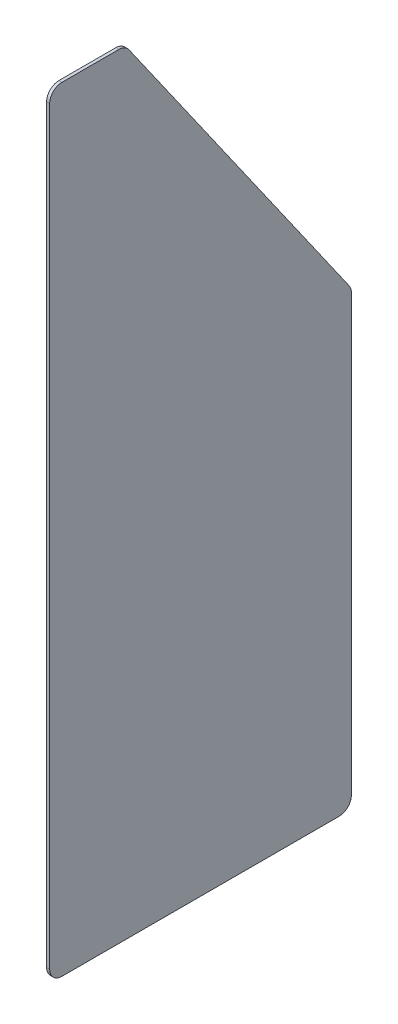
ISO-10303-21;
HEADER;
FILE_DESCRIPTION(('STEP AP214'),'2;1');
FILE_NAME('part.step','',(''),(''),'','','');
FILE_SCHEMA(('AUTOMOTIVE_DESIGN { 1 0 10303 214 1 1 1 1 }'));
ENDSEC;
DATA;
#1=APPLICATION_CONTEXT('core data for automotive mechanical design processes');
#2=APPLICATION_PROTOCOL_DEFINITION('international standard','automotive_design',2000,#1);
#3=PRODUCT_CONTEXT('',#1,'mechanical');
#4=PRODUCT('Part','Part','',(#3));
#5=PRODUCT_RELATED_PRODUCT_CATEGORY('part','',(#4));
#6=PRODUCT_DEFINITION_FORMATION('','',#4);
#7=PRODUCT_DEFINITION_CONTEXT('part definition',#1,'design');
#8=PRODUCT_DEFINITION('design','',#6,#7);
#9=PRODUCT_DEFINITION_SHAPE('','',#8);
#10=(LENGTH_UNIT() NAMED_UNIT(*) SI_UNIT(.MILLI.,.METRE.));
#11=(NAMED_UNIT(*) PLANE_ANGLE_UNIT() SI_UNIT($,.RADIAN.));
#12=(NAMED_UNIT(*) SI_UNIT($,.STERADIAN.) SOLID_ANGLE_UNIT());
#13=UNCERTAINTY_MEASURE_WITH_UNIT(LENGTH_MEASURE(1.E-05),#10,'distance_accuracy_value','');
#14=(GEOMETRIC_REPRESENTATION_CONTEXT(3) GLOBAL_UNCERTAINTY_ASSIGNED_CONTEXT((#13)) GLOBAL_UNIT_ASSIGNED_CONTEXT((#10,
#11,#12)) REPRESENTATION_CONTEXT('',''));
#15=CARTESIAN_POINT('',(0.,0.,0.));
#16=DIRECTION('',(0.,0.,1.));
#17=DIRECTION('',(1.,0.,0.));
#18=AXIS2_PLACEMENT_3D('',#15,#16,#17);
#19=CARTESIAN_POINT('',(1.58750000000002,400.05,0.));
#20=DIRECTION('',(0.,0.,-1.));
#21=DIRECTION('',(-1.,0.,0.));
#22=AXIS2_PLACEMENT_3D('',#19,#20,#21);
#23=PLANE('',#22);
#24=DIRECTION('',(0.,-1.,0.));
#25=VECTOR('',#24,1.);
#26=CARTESIAN_POINT('',(0.,400.05,0.));
#27=LINE('',#26,#25);
#28=CARTESIAN_POINT('',(0.,393.7,0.));
#29=VERTEX_POINT('',#28);
#30=CARTESIAN_POINT('',(0.,6.35000000000013,0.));
#31=VERTEX_POINT('',#30);
#32=EDGE_CURVE('E134',#29,#31,#27,.T.);
#33=ORIENTED_EDGE('',*,*,#32,.T.);
#34=DIRECTION('',(1.,0.,0.));
#35=VECTOR('',#34,1.);
#36=CARTESIAN_POINT('',(1.58750000000002,6.35000000000002,0.));
#37=LINE('',#36,#35);
#38=CARTESIAN_POINT('',(1.58750000000002,6.35000000000013,0.));
#39=VERTEX_POINT('',#38);
#40=EDGE_CURVE('E164',#31,#39,#37,.T.);
#41=ORIENTED_EDGE('',*,*,#40,.T.);
#42=DIRECTION('',(0.,-1.,0.));
#43=VECTOR('',#42,1.);
#44=CARTESIAN_POINT('',(1.58750000000002,400.05,0.));
#45=LINE('',#44,#43);
#46=CARTESIAN_POINT('',(1.58750000000002,393.7,0.));
#47=VERTEX_POINT('',#46);
#48=EDGE_CURVE('E138',#47,#39,#45,.T.);
#49=ORIENTED_EDGE('',*,*,#48,.F.);
#50=DIRECTION('',(1.,0.,0.));
#51=VECTOR('',#50,1.);
#52=CARTESIAN_POINT('',(0.,393.7,0.));
#53=LINE('',#52,#51);
#54=EDGE_CURVE('E162',#47,#29,#53,.F.);
#55=ORIENTED_EDGE('',*,*,#54,.T.);
#56=EDGE_LOOP('',(#33,#41,#49,#55));
#57=FACE_BOUND('',#56,.T.);
#58=ADVANCED_FACE('F35',(#57),#23,.F.);
#59=CARTESIAN_POINT('',(1.5875,400.05,-155.8925));
#60=DIRECTION('',(-1.,0.,0.));
#61=DIRECTION('',(0.,0.,1.));
#62=AXIS2_PLACEMENT_3D('',#59,#60,#61);
#63=PLANE('',#62);
#64=DIRECTION('',(0.,0.,-1.));
#65=VECTOR('',#64,1.);
#66=CARTESIAN_POINT('',(1.5875,0.,-155.8925));
#67=LINE('',#66,#65);
#68=CARTESIAN_POINT('',(1.58750000000002,0.,-6.35000000000005));
#69=VERTEX_POINT('',#68);
#70=CARTESIAN_POINT('',(1.5875,0.,-149.5425));
#71=VERTEX_POINT('',#70);
#72=EDGE_CURVE('E178',#69,#71,#67,.T.);
#73=ORIENTED_EDGE('',*,*,#72,.T.);
#74=CARTESIAN_POINT('',(1.5875,6.35000000000002,-149.5425));
#75=DIRECTION('',(-1.,0.,0.));
#76=DIRECTION('',(0.,0.,1.));
#77=AXIS2_PLACEMENT_3D('',#74,#75,#76);
#78=CIRCLE('',#77,6.35);
#79=CARTESIAN_POINT('',(1.5875,6.35000000000013,-155.8925));
#80=VERTEX_POINT('',#79);
#81=EDGE_CURVE('E160',#71,#80,#78,.F.);
#82=ORIENTED_EDGE('',*,*,#81,.T.);
#83=DIRECTION('',(0.,-1.,0.));
#84=VECTOR('',#83,1.);
#85=CARTESIAN_POINT('',(1.5875,400.05,-155.8925));
#86=LINE('',#85,#84);
#87=CARTESIAN_POINT('',(1.5875,231.169852690618,-155.8925));
#88=VERTEX_POINT('',#87);
#89=EDGE_CURVE('E133',#88,#80,#86,.T.);
#90=ORIENTED_EDGE('',*,*,#89,.F.);
#91=CARTESIAN_POINT('',(1.58749999999999,231.169852690618,-149.5425));
#92=DIRECTION('',(-1.,0.,0.));
#93=DIRECTION('',(0.,0.,1.));
#94=AXIS2_PLACEMENT_3D('',#91,#92,#93);
#95=CIRCLE('',#94,6.35);
#96=CARTESIAN_POINT('',(1.58749999999998,234.812063061448,-154.744115481235));
#97=VERTEX_POINT('',#96);
#98=EDGE_CURVE('E137',#88,#97,#95,.F.);
#99=ORIENTED_EDGE('',*,*,#98,.T.);
#100=DIRECTION('',(0.,-0.819152044288989,-0.57357643635105));
#101=VECTOR('',#100,1.);
#102=CARTESIAN_POINT('',(1.58749999999999,400.05,-39.0432664386388));
#103=LINE('',#102,#101);
#104=CARTESIAN_POINT('',(1.58749999999999,397.342210370829,-40.9392811488703));
#105=VERTEX_POINT('',#104);
#106=EDGE_CURVE('E176',#105,#97,#103,.T.);
#107=ORIENTED_EDGE('',*,*,#106,.F.);
#108=CARTESIAN_POINT('',(1.58750000000001,393.7,-35.7376656676352));
#109=DIRECTION('',(-1.,0.,0.));
#110=DIRECTION('',(0.,0.,1.));
#111=AXIS2_PLACEMENT_3D('',#108,#109,#110);
#112=CIRCLE('',#111,6.35);
#113=CARTESIAN_POINT('',(1.58750000000001,400.05,-35.7376656676353));
#114=VERTEX_POINT('',#113);
#115=EDGE_CURVE('E156',#105,#114,#112,.F.);
#116=ORIENTED_EDGE('',*,*,#115,.T.);
#117=DIRECTION('',(0.,0.,-1.));
#118=VECTOR('',#117,1.);
#119=CARTESIAN_POINT('',(1.5875,400.05,-155.8925));
#120=LINE('',#119,#118);
#121=CARTESIAN_POINT('',(1.58750000000002,400.05,-6.35000000000005));
#122=VERTEX_POINT('',#121);
#123=EDGE_CURVE('E185',#122,#114,#120,.T.);
#124=ORIENTED_EDGE('',*,*,#123,.F.);
#125=CARTESIAN_POINT('',(1.58750000000002,393.7,-6.35));
#126=DIRECTION('',(-1.,0.,0.));
#127=DIRECTION('',(0.,0.,1.));
#128=AXIS2_PLACEMENT_3D('',#125,#126,#127);
#129=CIRCLE('',#128,6.35);
#130=EDGE_CURVE('E58',#122,#47,#129,.F.);
#131=ORIENTED_EDGE('',*,*,#130,.T.);
#132=ORIENTED_EDGE('',*,*,#48,.T.);
#133=CARTESIAN_POINT('',(1.58750000000002,6.35000000000002,-6.35));
#134=DIRECTION('',(-1.,0.,0.));
#135=DIRECTION('',(0.,0.,1.));
#136=AXIS2_PLACEMENT_3D('',#133,#134,#135);
#137=CIRCLE('',#136,6.35);
#138=EDGE_CURVE('E50',#39,#69,#137,.F.);
#139=ORIENTED_EDGE('',*,*,#138,.T.);
#140=EDGE_LOOP('',(#73,#82,#90,#99,#107,#116,#124,#131,#132,#139));
#141=FACE_BOUND('',#140,.T.);
#142=ADVANCED_FACE('F217',(#141),#63,.F.);
#143=CARTESIAN_POINT('',(1.5875,400.05,-155.8925));
#144=DIRECTION('',(0.,0.,1.));
#145=DIRECTION('',(1.,0.,0.));
#146=AXIS2_PLACEMENT_3D('',#143,#144,#145);
#147=PLANE('',#146);
#148=ORIENTED_EDGE('',*,*,#89,.T.);
#149=DIRECTION('',(-1.,0.,0.));
#150=VECTOR('',#149,1.);
#151=CARTESIAN_POINT('',(1.5875,6.35000000000002,-155.8925));
#152=LINE('',#151,#150);
#153=CARTESIAN_POINT('',(0.,6.35000000000013,-155.8925));
#154=VERTEX_POINT('',#153);
#155=EDGE_CURVE('E124',#80,#154,#152,.T.);
#156=ORIENTED_EDGE('',*,*,#155,.T.);
#157=DIRECTION('',(0.,-1.,0.));
#158=VECTOR('',#157,1.);
#159=CARTESIAN_POINT('',(0.,400.05,-155.8925));
#160=LINE('',#159,#158);
#161=CARTESIAN_POINT('',(0.,231.169852690618,-155.8925));
#162=VERTEX_POINT('',#161);
#163=EDGE_CURVE('E116',#162,#154,#160,.T.);
#164=ORIENTED_EDGE('',*,*,#163,.F.);
#165=DIRECTION('',(-1.,0.,0.));
#166=VECTOR('',#165,1.);
#167=CARTESIAN_POINT('',(1.5875,231.169852690618,-155.8925));
#168=LINE('',#167,#166);
#169=EDGE_CURVE('E130',#162,#88,#168,.F.);
#170=ORIENTED_EDGE('',*,*,#169,.T.);
#171=EDGE_LOOP('',(#148,#156,#164,#170));
#172=FACE_BOUND('',#171,.T.);
#173=ADVANCED_FACE('F129',(#172),#147,.F.);
#174=CARTESIAN_POINT('',(0.,400.05,-155.8925));
#175=DIRECTION('',(1.,0.,0.));
#176=DIRECTION('',(0.,0.,-1.));
#177=AXIS2_PLACEMENT_3D('',#174,#175,#176);
#178=PLANE('',#177);
#179=ORIENTED_EDGE('',*,*,#163,.T.);
#180=CARTESIAN_POINT('',(0.,6.35000000000002,-149.5425));
#181=DIRECTION('',(1.,0.,0.));
#182=DIRECTION('',(0.,0.,-1.));
#183=AXIS2_PLACEMENT_3D('',#180,#181,#182);
#184=CIRCLE('',#183,6.35);
#185=CARTESIAN_POINT('',(0.,0.,-149.5425));
#186=VERTEX_POINT('',#185);
#187=EDGE_CURVE('E149',#154,#186,#184,.F.);
#188=ORIENTED_EDGE('',*,*,#187,.T.);
#189=DIRECTION('',(0.,0.,1.));
#190=VECTOR('',#189,1.);
#191=CARTESIAN_POINT('',(0.,0.,-155.8925));
#192=LINE('',#191,#190);
#193=CARTESIAN_POINT('',(0.,0.,-6.35000000000005));
#194=VERTEX_POINT('',#193);
#195=EDGE_CURVE('E181',#186,#194,#192,.T.);
#196=ORIENTED_EDGE('',*,*,#195,.T.);
#197=CARTESIAN_POINT('',(0.,6.35000000000002,-6.35));
#198=DIRECTION('',(1.,0.,0.));
#199=DIRECTION('',(0.,0.,-1.));
#200=AXIS2_PLACEMENT_3D('',#197,#198,#199);
#201=CIRCLE('',#200,6.35);
#202=EDGE_CURVE('E147',#194,#31,#201,.F.);
#203=ORIENTED_EDGE('',*,*,#202,.T.);
#204=ORIENTED_EDGE('',*,*,#32,.F.);
#205=CARTESIAN_POINT('',(0.,393.7,-6.35));
#206=DIRECTION('',(1.,0.,0.));
#207=DIRECTION('',(0.,0.,-1.));
#208=AXIS2_PLACEMENT_3D('',#205,#206,#207);
#209=CIRCLE('',#208,6.35);
#210=CARTESIAN_POINT('',(0.,400.05,-6.35000000000005));
#211=VERTEX_POINT('',#210);
#212=EDGE_CURVE('E145',#29,#211,#209,.F.);
#213=ORIENTED_EDGE('',*,*,#212,.T.);
#214=DIRECTION('',(0.,0.,1.));
#215=VECTOR('',#214,1.);
#216=CARTESIAN_POINT('',(0.,400.05,-155.8925));
#217=LINE('',#216,#215);
#218=CARTESIAN_POINT('',(0.,400.05,-35.7376656676353));
#219=VERTEX_POINT('',#218);
#220=EDGE_CURVE('E188',#219,#211,#217,.T.);
#221=ORIENTED_EDGE('',*,*,#220,.F.);
#222=CARTESIAN_POINT('',(0.,393.7,-35.7376656676352));
#223=DIRECTION('',(1.,0.,0.));
#224=DIRECTION('',(0.,0.,-1.));
#225=AXIS2_PLACEMENT_3D('',#222,#223,#224);
#226=CIRCLE('',#225,6.35);
#227=CARTESIAN_POINT('',(0.,397.342210370829,-40.9392811488703));
#228=VERTEX_POINT('',#227);
#229=EDGE_CURVE('E123',#219,#228,#226,.F.);
#230=ORIENTED_EDGE('',*,*,#229,.T.);
#231=DIRECTION('',(0.,0.819152044288989,0.57357643635105));
#232=VECTOR('',#231,1.);
#233=CARTESIAN_POINT('',(0.,400.05,-39.0432664386388));
#234=LINE('',#233,#232);
#235=CARTESIAN_POINT('',(0.,234.812063061448,-154.744115481235));
#236=VERTEX_POINT('',#235);
#237=EDGE_CURVE('E118',#236,#228,#234,.T.);
#238=ORIENTED_EDGE('',*,*,#237,.F.);
#239=CARTESIAN_POINT('',(0.,231.169852690618,-149.5425));
#240=DIRECTION('',(1.,0.,0.));
#241=DIRECTION('',(0.,0.,-1.));
#242=AXIS2_PLACEMENT_3D('',#239,#240,#241);
#243=CIRCLE('',#242,6.35);
#244=EDGE_CURVE('E113',#236,#162,#243,.F.);
#245=ORIENTED_EDGE('',*,*,#244,.T.);
#246=EDGE_LOOP('',(#179,#188,#196,#203,#204,#213,#221,#230,#238,#245));
#247=FACE_BOUND('',#246,.T.);
#248=ADVANCED_FACE('F115',(#247),#178,.F.);
#249=CARTESIAN_POINT('',(0.,400.05,0.));
#250=DIRECTION('',(0.,1.,0.));
#251=DIRECTION('',(0.,0.,1.));
#252=AXIS2_PLACEMENT_3D('',#249,#250,#251);
#253=PLANE('',#252);
#254=ORIENTED_EDGE('',*,*,#220,.T.);
#255=DIRECTION('',(1.,0.,0.));
#256=VECTOR('',#255,1.);
#257=CARTESIAN_POINT('',(1.58750000000003,400.05,-6.35));
#258=LINE('',#257,#256);
#259=EDGE_CURVE('E169',#211,#122,#258,.T.);
#260=ORIENTED_EDGE('',*,*,#259,.T.);
#261=ORIENTED_EDGE('',*,*,#123,.T.);
#262=DIRECTION('',(-1.,0.,0.));
#263=VECTOR('',#262,1.);
#264=CARTESIAN_POINT('',(0.,400.05,-35.7376656676352));
#265=LINE('',#264,#263);
#266=EDGE_CURVE('E166',#114,#219,#265,.T.);
#267=ORIENTED_EDGE('',*,*,#266,.T.);
#268=EDGE_LOOP('',(#254,#260,#261,#267));
#269=FACE_BOUND('',#268,.T.);
#270=ADVANCED_FACE('F213',(#269),#253,.T.);
#271=CARTESIAN_POINT('',(0.,0.,0.));
#272=DIRECTION('',(0.,1.,0.));
#273=DIRECTION('',(0.,0.,1.));
#274=AXIS2_PLACEMENT_3D('',#271,#272,#273);
#275=PLANE('',#274);
#276=ORIENTED_EDGE('',*,*,#195,.F.);
#277=DIRECTION('',(-1.,0.,0.));
#278=VECTOR('',#277,1.);
#279=CARTESIAN_POINT('',(0.,0.,-149.5425));
#280=LINE('',#279,#278);
#281=EDGE_CURVE('E153',#186,#71,#280,.F.);
#282=ORIENTED_EDGE('',*,*,#281,.T.);
#283=ORIENTED_EDGE('',*,*,#72,.F.);
#284=DIRECTION('',(1.,0.,0.));
#285=VECTOR('',#284,1.);
#286=CARTESIAN_POINT('',(0.,0.,-6.35));
#287=LINE('',#286,#285);
#288=EDGE_CURVE('E151',#69,#194,#287,.F.);
#289=ORIENTED_EDGE('',*,*,#288,.T.);
#290=EDGE_LOOP('',(#276,#282,#283,#289));
#291=FACE_BOUND('',#290,.T.);
#292=ADVANCED_FACE('F201',(#291),#275,.F.);
#293=CARTESIAN_POINT('',(205.307921823335,400.05,-39.0432664386388));
#294=DIRECTION('',(0.,-0.57357643635105,0.819152044288989));
#295=DIRECTION('',(0.,-0.819152044288989,-0.57357643635105));
#296=AXIS2_PLACEMENT_3D('',#293,#294,#295);
#297=PLANE('',#296);
#298=ORIENTED_EDGE('',*,*,#237,.T.);
#299=DIRECTION('',(-1.,0.,0.));
#300=VECTOR('',#299,1.);
#301=CARTESIAN_POINT('',(1.58749999999999,397.342210370829,-40.9392811488703));
#302=LINE('',#301,#300);
#303=EDGE_CURVE('E11',#228,#105,#302,.F.);
#304=ORIENTED_EDGE('',*,*,#303,.T.);
#305=ORIENTED_EDGE('',*,*,#106,.T.);
#306=DIRECTION('',(-1.,0.,0.));
#307=VECTOR('',#306,1.);
#308=CARTESIAN_POINT('',(205.307921823335,234.812063061448,-154.744115481235));
#309=LINE('',#308,#307);
#310=EDGE_CURVE('E43',#97,#236,#309,.T.);
#311=ORIENTED_EDGE('',*,*,#310,.T.);
#312=EDGE_LOOP('',(#298,#304,#305,#311));
#313=FACE_BOUND('',#312,.T.);
#314=ADVANCED_FACE('F173',(#313),#297,.F.);
#315=CARTESIAN_POINT('',(1.5875,6.35000000000002,-149.5425));
#316=DIRECTION('',(-1.,0.,0.));
#317=DIRECTION('',(0.,0.,1.));
#318=AXIS2_PLACEMENT_3D('',#315,#316,#317);
#319=CYLINDRICAL_SURFACE('',#318,6.35);
#320=ORIENTED_EDGE('',*,*,#81,.F.);
#321=ORIENTED_EDGE('',*,*,#281,.F.);
#322=ORIENTED_EDGE('',*,*,#187,.F.);
#323=ORIENTED_EDGE('',*,*,#155,.F.);
#324=EDGE_LOOP('',(#320,#321,#322,#323));
#325=FACE_BOUND('',#324,.T.);
#326=ADVANCED_FACE('F196',(#325),#319,.T.);
#327=CARTESIAN_POINT('',(1.58750000000003,6.35000000000002,-6.35));
#328=DIRECTION('',(1.,0.,0.));
#329=DIRECTION('',(0.,0.,-1.));
#330=AXIS2_PLACEMENT_3D('',#327,#328,#329);
#331=CYLINDRICAL_SURFACE('',#330,6.35);
#332=ORIENTED_EDGE('',*,*,#202,.F.);
#333=ORIENTED_EDGE('',*,*,#288,.F.);
#334=ORIENTED_EDGE('',*,*,#138,.F.);
#335=ORIENTED_EDGE('',*,*,#40,.F.);
#336=EDGE_LOOP('',(#332,#333,#334,#335));
#337=FACE_BOUND('',#336,.T.);
#338=ADVANCED_FACE('F203',(#337),#331,.T.);
#339=CARTESIAN_POINT('',(0.,393.7,-6.35));
#340=DIRECTION('',(-1.,0.,0.));
#341=DIRECTION('',(0.,0.,1.));
#342=AXIS2_PLACEMENT_3D('',#339,#340,#341);
#343=CYLINDRICAL_SURFACE('',#342,6.35);
#344=ORIENTED_EDGE('',*,*,#212,.F.);
#345=ORIENTED_EDGE('',*,*,#54,.F.);
#346=ORIENTED_EDGE('',*,*,#130,.F.);
#347=ORIENTED_EDGE('',*,*,#259,.F.);
#348=EDGE_LOOP('',(#344,#345,#346,#347));
#349=FACE_BOUND('',#348,.T.);
#350=ADVANCED_FACE('F209',(#349),#343,.T.);
#351=CARTESIAN_POINT('',(0.,393.7,-35.7376656676352));
#352=DIRECTION('',(1.,0.,0.));
#353=DIRECTION('',(0.,0.,-1.));
#354=AXIS2_PLACEMENT_3D('',#351,#352,#353);
#355=CYLINDRICAL_SURFACE('',#354,6.35);
#356=ORIENTED_EDGE('',*,*,#115,.F.);
#357=ORIENTED_EDGE('',*,*,#303,.F.);
#358=ORIENTED_EDGE('',*,*,#229,.F.);
#359=ORIENTED_EDGE('',*,*,#266,.F.);
#360=EDGE_LOOP('',(#356,#357,#358,#359));
#361=FACE_BOUND('',#360,.T.);
#362=ADVANCED_FACE('F216',(#361),#355,.T.);
#363=CARTESIAN_POINT('',(205.307921823335,231.169852690618,-149.5425));
#364=DIRECTION('',(-1.,0.,0.));
#365=DIRECTION('',(0.,0.,1.));
#366=AXIS2_PLACEMENT_3D('',#363,#364,#365);
#367=CYLINDRICAL_SURFACE('',#366,6.35);
#368=ORIENTED_EDGE('',*,*,#98,.F.);
#369=ORIENTED_EDGE('',*,*,#169,.F.);
#370=ORIENTED_EDGE('',*,*,#244,.F.);
#371=ORIENTED_EDGE('',*,*,#310,.F.);
#372=EDGE_LOOP('',(#368,#369,#370,#371));
#373=FACE_BOUND('',#372,.T.);
#374=ADVANCED_FACE('F37',(#373),#367,.T.);
#375=CLOSED_SHELL('',(#58,#142,#173,#248,#270,#292,#314,#326,#338,#350,#362,#374));
#376=MANIFOLD_SOLID_BREP('B2',#375);
#377=ADVANCED_BREP_SHAPE_REPRESENTATION('',(#18,#376),#14);
#378=SHAPE_DEFINITION_REPRESENTATION(#9,#377);
ENDSEC;
END-ISO-10303-21;
